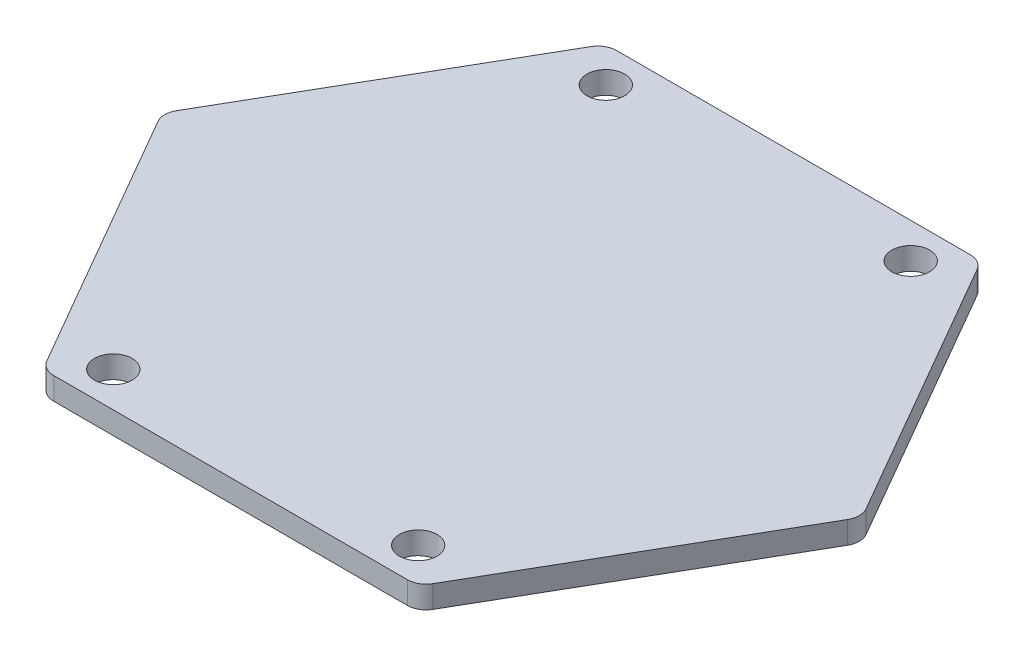
ISO-10303-21;
HEADER;
FILE_DESCRIPTION(('STEP AP214'),'2;1');
FILE_NAME('part.step','',(''),(''),'','','');
FILE_SCHEMA(('AUTOMOTIVE_DESIGN { 1 0 10303 214 1 1 1 1 }'));
ENDSEC;
DATA;
#1=APPLICATION_CONTEXT('core data for automotive mechanical design processes');
#2=APPLICATION_PROTOCOL_DEFINITION('international standard','automotive_design',2000,#1);
#3=PRODUCT_CONTEXT('',#1,'mechanical');
#4=PRODUCT('Part','Part','',(#3));
#5=PRODUCT_RELATED_PRODUCT_CATEGORY('part','',(#4));
#6=PRODUCT_DEFINITION_FORMATION('','',#4);
#7=PRODUCT_DEFINITION_CONTEXT('part definition',#1,'design');
#8=PRODUCT_DEFINITION('design','',#6,#7);
#9=PRODUCT_DEFINITION_SHAPE('','',#8);
#10=(LENGTH_UNIT() NAMED_UNIT(*) SI_UNIT(.MILLI.,.METRE.));
#11=(NAMED_UNIT(*) PLANE_ANGLE_UNIT() SI_UNIT($,.RADIAN.));
#12=(NAMED_UNIT(*) SI_UNIT($,.STERADIAN.) SOLID_ANGLE_UNIT());
#13=UNCERTAINTY_MEASURE_WITH_UNIT(LENGTH_MEASURE(1.E-05),#10,'distance_accuracy_value','');
#14=(GEOMETRIC_REPRESENTATION_CONTEXT(3) GLOBAL_UNCERTAINTY_ASSIGNED_CONTEXT((#13)) GLOBAL_UNIT_ASSIGNED_CONTEXT((#10,
#11,#12)) REPRESENTATION_CONTEXT('',''));
#15=CARTESIAN_POINT('',(0.,0.,0.));
#16=DIRECTION('',(0.,0.,1.));
#17=DIRECTION('',(1.,0.,0.));
#18=AXIS2_PLACEMENT_3D('',#15,#16,#17);
#19=CARTESIAN_POINT('',(0.,31.8516,0.));
#20=DIRECTION('',(0.,1.,0.));
#21=DIRECTION('',(0.,0.,1.));
#22=AXIS2_PLACEMENT_3D('',#19,#20,#21);
#23=PLANE('',#22);
#24=CARTESIAN_POINT('',(-20.6375,31.8516,138.2395));
#25=DIRECTION('',(0.,1.,0.));
#26=DIRECTION('',(0.,0.,1.));
#27=AXIS2_PLACEMENT_3D('',#24,#25,#26);
#28=CIRCLE('',#27,2.5527);
#29=CARTESIAN_POINT('',(-20.6375,31.8516,140.7922));
#30=VERTEX_POINT('',#29);
#31=EDGE_CURVE('E294',#30,#30,#28,.T.);
#32=ORIENTED_EDGE('',*,*,#31,.F.);
#33=EDGE_LOOP('',(#32));
#34=FACE_BOUND('',#33,.T.);
#35=CARTESIAN_POINT('',(20.6375,31.8516,71.5645));
#36=DIRECTION('',(0.,1.,0.));
#37=DIRECTION('',(0.,0.,1.));
#38=AXIS2_PLACEMENT_3D('',#35,#36,#37);
#39=CIRCLE('',#38,2.5527);
#40=CARTESIAN_POINT('',(20.6375,31.8516,74.1172));
#41=VERTEX_POINT('',#40);
#42=EDGE_CURVE('E233',#41,#41,#39,.T.);
#43=ORIENTED_EDGE('',*,*,#42,.F.);
#44=EDGE_LOOP('',(#43));
#45=FACE_BOUND('',#44,.T.);
#46=DIRECTION('',(-0.500000000000001,0.,0.866025403784438));
#47=VECTOR('',#46,1.);
#48=CARTESIAN_POINT('',(-47.3970452561248,31.8516,104.902));
#49=LINE('',#48,#47);
#50=CARTESIAN_POINT('',(-26.1332348418708,31.8516,68.072));
#51=VERTEX_POINT('',#50);
#52=CARTESIAN_POINT('',(-46.663810414254,31.8516,103.632));
#53=VERTEX_POINT('',#52);
#54=EDGE_CURVE('E226',#51,#53,#49,.T.);
#55=ORIENTED_EDGE('',*,*,#54,.T.);
#56=CARTESIAN_POINT('',(-44.4641058886415,31.8516,104.902));
#57=DIRECTION('',(0.,1.,0.));
#58=DIRECTION('',(0.,0.,1.));
#59=AXIS2_PLACEMENT_3D('',#56,#57,#58);
#60=CIRCLE('',#59,2.54);
#61=CARTESIAN_POINT('',(-46.663810414254,31.8516,106.172));
#62=VERTEX_POINT('',#61);
#63=EDGE_CURVE('E182',#53,#62,#60,.T.);
#64=ORIENTED_EDGE('',*,*,#63,.T.);
#65=DIRECTION('',(0.500000000000001,0.,0.866025403784438));
#66=VECTOR('',#65,1.);
#67=CARTESIAN_POINT('',(-25.4,31.8516,143.002));
#68=LINE('',#67,#66);
#69=CARTESIAN_POINT('',(-26.1332348418708,31.8516,141.732));
#70=VERTEX_POINT('',#69);
#71=EDGE_CURVE('E144',#62,#70,#68,.T.);
#72=ORIENTED_EDGE('',*,*,#71,.T.);
#73=CARTESIAN_POINT('',(-23.9335303162583,31.8516,140.462));
#74=DIRECTION('',(0.,1.,0.));
#75=DIRECTION('',(0.,0.,1.));
#76=AXIS2_PLACEMENT_3D('',#73,#74,#75);
#77=CIRCLE('',#76,2.54);
#78=CARTESIAN_POINT('',(-23.9335303162583,31.8516,143.002));
#79=VERTEX_POINT('',#78);
#80=EDGE_CURVE('E56',#70,#79,#77,.T.);
#81=ORIENTED_EDGE('',*,*,#80,.T.);
#82=DIRECTION('',(1.,0.,0.));
#83=VECTOR('',#82,1.);
#84=CARTESIAN_POINT('',(-25.4,31.8516,143.002));
#85=LINE('',#84,#83);
#86=CARTESIAN_POINT('',(23.9335303162583,31.8516,143.002));
#87=VERTEX_POINT('',#86);
#88=EDGE_CURVE('E160',#79,#87,#85,.T.);
#89=ORIENTED_EDGE('',*,*,#88,.T.);
#90=CARTESIAN_POINT('',(23.9335303162583,31.8516,140.462));
#91=DIRECTION('',(0.,1.,0.));
#92=DIRECTION('',(0.,0.,1.));
#93=AXIS2_PLACEMENT_3D('',#90,#91,#92);
#94=CIRCLE('',#93,2.54);
#95=CARTESIAN_POINT('',(26.1332348418708,31.8516,141.732));
#96=VERTEX_POINT('',#95);
#97=EDGE_CURVE('E174',#87,#96,#94,.T.);
#98=ORIENTED_EDGE('',*,*,#97,.T.);
#99=DIRECTION('',(0.500000000000001,0.,-0.866025403784438));
#100=VECTOR('',#99,1.);
#101=CARTESIAN_POINT('',(47.3970452561248,31.8516,104.902));
#102=LINE('',#101,#100);
#103=CARTESIAN_POINT('',(46.663810414254,31.8516,106.172));
#104=VERTEX_POINT('',#103);
#105=EDGE_CURVE('E154',#96,#104,#102,.T.);
#106=ORIENTED_EDGE('',*,*,#105,.T.);
#107=CARTESIAN_POINT('',(44.4641058886415,31.8516,104.902));
#108=DIRECTION('',(0.,1.,0.));
#109=DIRECTION('',(0.,0.,1.));
#110=AXIS2_PLACEMENT_3D('',#107,#108,#109);
#111=CIRCLE('',#110,2.54);
#112=CARTESIAN_POINT('',(46.663810414254,31.8516,103.632));
#113=VERTEX_POINT('',#112);
#114=EDGE_CURVE('E176',#104,#113,#111,.T.);
#115=ORIENTED_EDGE('',*,*,#114,.T.);
#116=DIRECTION('',(-0.500000000000001,0.,-0.866025403784438));
#117=VECTOR('',#116,1.);
#118=CARTESIAN_POINT('',(25.4,31.8516,66.802));
#119=LINE('',#118,#117);
#120=CARTESIAN_POINT('',(26.1332348418708,31.8516,68.072));
#121=VERTEX_POINT('',#120);
#122=EDGE_CURVE('E215',#113,#121,#119,.T.);
#123=ORIENTED_EDGE('',*,*,#122,.T.);
#124=CARTESIAN_POINT('',(23.9335303162583,31.8516,69.342));
#125=DIRECTION('',(0.,1.,0.));
#126=DIRECTION('',(0.,0.,1.));
#127=AXIS2_PLACEMENT_3D('',#124,#125,#126);
#128=CIRCLE('',#127,2.54);
#129=CARTESIAN_POINT('',(23.9335303162583,31.8516,66.802));
#130=VERTEX_POINT('',#129);
#131=EDGE_CURVE('E178',#121,#130,#128,.T.);
#132=ORIENTED_EDGE('',*,*,#131,.T.);
#133=DIRECTION('',(-1.,0.,0.));
#134=VECTOR('',#133,1.);
#135=CARTESIAN_POINT('',(-25.4,31.8516,66.802));
#136=LINE('',#135,#134);
#137=CARTESIAN_POINT('',(-23.9335303162584,31.8516,66.802));
#138=VERTEX_POINT('',#137);
#139=EDGE_CURVE('E218',#130,#138,#136,.T.);
#140=ORIENTED_EDGE('',*,*,#139,.T.);
#141=CARTESIAN_POINT('',(-23.9335303162584,31.8516,69.342));
#142=DIRECTION('',(0.,1.,0.));
#143=DIRECTION('',(0.,0.,1.));
#144=AXIS2_PLACEMENT_3D('',#141,#142,#143);
#145=CIRCLE('',#144,2.54);
#146=EDGE_CURVE('E180',#138,#51,#145,.T.);
#147=ORIENTED_EDGE('',*,*,#146,.T.);
#148=EDGE_LOOP('',(#55,#64,#72,#81,#89,#98,#106,#115,#123,#132,#140,#147));
#149=FACE_BOUND('',#148,.T.);
#150=CARTESIAN_POINT('',(-20.6375,31.8516,71.5645));
#151=DIRECTION('',(0.,1.,0.));
#152=DIRECTION('',(0.,0.,1.));
#153=AXIS2_PLACEMENT_3D('',#150,#151,#152);
#154=CIRCLE('',#153,2.5527);
#155=CARTESIAN_POINT('',(-20.6375,31.8516,74.1172));
#156=VERTEX_POINT('',#155);
#157=EDGE_CURVE('E288',#156,#156,#154,.T.);
#158=ORIENTED_EDGE('',*,*,#157,.F.);
#159=EDGE_LOOP('',(#158));
#160=FACE_BOUND('',#159,.T.);
#161=CARTESIAN_POINT('',(20.6375,31.8516,138.2395));
#162=DIRECTION('',(0.,1.,0.));
#163=DIRECTION('',(0.,0.,1.));
#164=AXIS2_PLACEMENT_3D('',#161,#162,#163);
#165=CIRCLE('',#164,2.5527);
#166=CARTESIAN_POINT('',(20.6375,31.8516,140.7922));
#167=VERTEX_POINT('',#166);
#168=EDGE_CURVE('E300',#167,#167,#165,.T.);
#169=ORIENTED_EDGE('',*,*,#168,.F.);
#170=EDGE_LOOP('',(#169));
#171=FACE_BOUND('',#170,.T.);
#172=ADVANCED_FACE('F36',(#34,#45,#149,#160,#171),#23,.T.);
#173=CARTESIAN_POINT('',(0.,28.829,0.));
#174=DIRECTION('',(0.,1.,0.));
#175=DIRECTION('',(0.,0.,1.));
#176=AXIS2_PLACEMENT_3D('',#173,#174,#175);
#177=PLANE('',#176);
#178=DIRECTION('',(0.500000000000001,0.,0.866025403784438));
#179=VECTOR('',#178,1.);
#180=CARTESIAN_POINT('',(-25.4,28.829,143.002));
#181=LINE('',#180,#179);
#182=CARTESIAN_POINT('',(-46.663810414254,28.829,106.172));
#183=VERTEX_POINT('',#182);
#184=CARTESIAN_POINT('',(-26.1332348418708,28.829,141.732));
#185=VERTEX_POINT('',#184);
#186=EDGE_CURVE('E142',#183,#185,#181,.T.);
#187=ORIENTED_EDGE('',*,*,#186,.F.);
#188=CARTESIAN_POINT('',(-44.4641058886415,28.829,104.902));
#189=DIRECTION('',(0.,1.,0.));
#190=DIRECTION('',(0.,0.,1.));
#191=AXIS2_PLACEMENT_3D('',#188,#189,#190);
#192=CIRCLE('',#191,2.54);
#193=CARTESIAN_POINT('',(-46.663810414254,28.829,103.632));
#194=VERTEX_POINT('',#193);
#195=EDGE_CURVE('E125',#183,#194,#192,.F.);
#196=ORIENTED_EDGE('',*,*,#195,.T.);
#197=DIRECTION('',(-0.500000000000001,0.,0.866025403784438));
#198=VECTOR('',#197,1.);
#199=CARTESIAN_POINT('',(-47.3970452561248,28.829,104.902));
#200=LINE('',#199,#198);
#201=CARTESIAN_POINT('',(-26.1332348418708,28.829,68.072));
#202=VERTEX_POINT('',#201);
#203=EDGE_CURVE('E152',#202,#194,#200,.T.);
#204=ORIENTED_EDGE('',*,*,#203,.F.);
#205=CARTESIAN_POINT('',(-23.9335303162584,28.829,69.342));
#206=DIRECTION('',(0.,1.,0.));
#207=DIRECTION('',(0.,0.,1.));
#208=AXIS2_PLACEMENT_3D('',#205,#206,#207);
#209=CIRCLE('',#208,2.54);
#210=CARTESIAN_POINT('',(-23.9335303162584,28.829,66.802));
#211=VERTEX_POINT('',#210);
#212=EDGE_CURVE('E136',#202,#211,#209,.F.);
#213=ORIENTED_EDGE('',*,*,#212,.T.);
#214=DIRECTION('',(-1.,0.,0.));
#215=VECTOR('',#214,1.);
#216=CARTESIAN_POINT('',(-25.4,28.829,66.802));
#217=LINE('',#216,#215);
#218=CARTESIAN_POINT('',(23.9335303162583,28.829,66.802));
#219=VERTEX_POINT('',#218);
#220=EDGE_CURVE('E156',#219,#211,#217,.T.);
#221=ORIENTED_EDGE('',*,*,#220,.F.);
#222=CARTESIAN_POINT('',(23.9335303162583,28.829,69.342));
#223=DIRECTION('',(0.,1.,0.));
#224=DIRECTION('',(0.,0.,1.));
#225=AXIS2_PLACEMENT_3D('',#222,#223,#224);
#226=CIRCLE('',#225,2.54);
#227=CARTESIAN_POINT('',(26.1332348418708,28.829,68.072));
#228=VERTEX_POINT('',#227);
#229=EDGE_CURVE('E167',#219,#228,#226,.F.);
#230=ORIENTED_EDGE('',*,*,#229,.T.);
#231=DIRECTION('',(-0.500000000000001,0.,-0.866025403784438));
#232=VECTOR('',#231,1.);
#233=CARTESIAN_POINT('',(25.4,28.829,66.802));
#234=LINE('',#233,#232);
#235=CARTESIAN_POINT('',(46.663810414254,28.829,103.632));
#236=VERTEX_POINT('',#235);
#237=EDGE_CURVE('E232',#236,#228,#234,.T.);
#238=ORIENTED_EDGE('',*,*,#237,.F.);
#239=CARTESIAN_POINT('',(44.4641058886415,28.829,104.902));
#240=DIRECTION('',(0.,1.,0.));
#241=DIRECTION('',(0.,0.,1.));
#242=AXIS2_PLACEMENT_3D('',#239,#240,#241);
#243=CIRCLE('',#242,2.54);
#244=CARTESIAN_POINT('',(46.663810414254,28.829,106.172));
#245=VERTEX_POINT('',#244);
#246=EDGE_CURVE('E165',#236,#245,#243,.F.);
#247=ORIENTED_EDGE('',*,*,#246,.T.);
#248=DIRECTION('',(0.500000000000001,0.,-0.866025403784438));
#249=VECTOR('',#248,1.);
#250=CARTESIAN_POINT('',(47.3970452561248,28.829,104.902));
#251=LINE('',#250,#249);
#252=CARTESIAN_POINT('',(26.1332348418708,28.829,141.732));
#253=VERTEX_POINT('',#252);
#254=EDGE_CURVE('E204',#253,#245,#251,.T.);
#255=ORIENTED_EDGE('',*,*,#254,.F.);
#256=CARTESIAN_POINT('',(23.9335303162583,28.829,140.462));
#257=DIRECTION('',(0.,1.,0.));
#258=DIRECTION('',(0.,0.,1.));
#259=AXIS2_PLACEMENT_3D('',#256,#257,#258);
#260=CIRCLE('',#259,2.54);
#261=CARTESIAN_POINT('',(23.9335303162583,28.829,143.002));
#262=VERTEX_POINT('',#261);
#263=EDGE_CURVE('E163',#253,#262,#260,.F.);
#264=ORIENTED_EDGE('',*,*,#263,.T.);
#265=DIRECTION('',(1.,0.,0.));
#266=VECTOR('',#265,1.);
#267=CARTESIAN_POINT('',(-25.4,28.829,143.002));
#268=LINE('',#267,#266);
#269=CARTESIAN_POINT('',(-23.9335303162583,28.829,143.002));
#270=VERTEX_POINT('',#269);
#271=EDGE_CURVE('E151',#270,#262,#268,.T.);
#272=ORIENTED_EDGE('',*,*,#271,.F.);
#273=CARTESIAN_POINT('',(-23.9335303162583,28.829,140.462));
#274=DIRECTION('',(0.,1.,0.));
#275=DIRECTION('',(0.,0.,1.));
#276=AXIS2_PLACEMENT_3D('',#273,#274,#275);
#277=CIRCLE('',#276,2.54);
#278=EDGE_CURVE('E145',#270,#185,#277,.F.);
#279=ORIENTED_EDGE('',*,*,#278,.T.);
#280=EDGE_LOOP('',(#187,#196,#204,#213,#221,#230,#238,#247,#255,#264,#272,#279));
#281=FACE_BOUND('',#280,.T.);
#282=CARTESIAN_POINT('',(20.6375,28.829,71.5645));
#283=DIRECTION('',(0.,1.,0.));
#284=DIRECTION('',(0.,0.,1.));
#285=AXIS2_PLACEMENT_3D('',#282,#283,#284);
#286=CIRCLE('',#285,2.5527);
#287=CARTESIAN_POINT('',(20.6375,28.829,74.1172));
#288=VERTEX_POINT('',#287);
#289=EDGE_CURVE('E221',#288,#288,#286,.T.);
#290=ORIENTED_EDGE('',*,*,#289,.T.);
#291=EDGE_LOOP('',(#290));
#292=FACE_BOUND('',#291,.T.);
#293=CARTESIAN_POINT('',(-20.6375,28.829,71.5645));
#294=DIRECTION('',(0.,1.,0.));
#295=DIRECTION('',(0.,0.,1.));
#296=AXIS2_PLACEMENT_3D('',#293,#294,#295);
#297=CIRCLE('',#296,2.5527);
#298=CARTESIAN_POINT('',(-20.6375,28.829,74.1172));
#299=VERTEX_POINT('',#298);
#300=EDGE_CURVE('E290',#299,#299,#297,.T.);
#301=ORIENTED_EDGE('',*,*,#300,.T.);
#302=EDGE_LOOP('',(#301));
#303=FACE_BOUND('',#302,.T.);
#304=CARTESIAN_POINT('',(-20.6375,28.829,138.2395));
#305=DIRECTION('',(0.,1.,0.));
#306=DIRECTION('',(0.,0.,1.));
#307=AXIS2_PLACEMENT_3D('',#304,#305,#306);
#308=CIRCLE('',#307,2.5527);
#309=CARTESIAN_POINT('',(-20.6375,28.829,140.7922));
#310=VERTEX_POINT('',#309);
#311=EDGE_CURVE('E297',#310,#310,#308,.T.);
#312=ORIENTED_EDGE('',*,*,#311,.T.);
#313=EDGE_LOOP('',(#312));
#314=FACE_BOUND('',#313,.T.);
#315=CARTESIAN_POINT('',(20.6375,28.829,138.2395));
#316=DIRECTION('',(0.,1.,0.));
#317=DIRECTION('',(0.,0.,1.));
#318=AXIS2_PLACEMENT_3D('',#315,#316,#317);
#319=CIRCLE('',#318,2.5527);
#320=CARTESIAN_POINT('',(20.6375,28.829,140.7922));
#321=VERTEX_POINT('',#320);
#322=EDGE_CURVE('E303',#321,#321,#319,.T.);
#323=ORIENTED_EDGE('',*,*,#322,.T.);
#324=EDGE_LOOP('',(#323));
#325=FACE_BOUND('',#324,.T.);
#326=ADVANCED_FACE('F148',(#281,#292,#303,#314,#325),#177,.F.);
#327=CARTESIAN_POINT('',(47.3970452561248,31.8516,104.902));
#328=DIRECTION('',(-0.866025403784438,0.,-0.500000000000001));
#329=DIRECTION('',(-0.500000000000001,0.,0.866025403784438));
#330=AXIS2_PLACEMENT_3D('',#327,#328,#329);
#331=PLANE('',#330);
#332=ORIENTED_EDGE('',*,*,#254,.T.);
#333=DIRECTION('',(0.,-1.,0.));
#334=VECTOR('',#333,1.);
#335=CARTESIAN_POINT('',(46.663810414254,31.8516,106.172));
#336=LINE('',#335,#334);
#337=EDGE_CURVE('E197',#245,#104,#336,.F.);
#338=ORIENTED_EDGE('',*,*,#337,.T.);
#339=ORIENTED_EDGE('',*,*,#105,.F.);
#340=DIRECTION('',(0.,-1.,0.));
#341=VECTOR('',#340,1.);
#342=CARTESIAN_POINT('',(26.1332348418708,31.8516,141.732));
#343=LINE('',#342,#341);
#344=EDGE_CURVE('E194',#96,#253,#343,.T.);
#345=ORIENTED_EDGE('',*,*,#344,.T.);
#346=EDGE_LOOP('',(#332,#338,#339,#345));
#347=FACE_BOUND('',#346,.T.);
#348=ADVANCED_FACE('F211',(#347),#331,.F.);
#349=CARTESIAN_POINT('',(25.4,31.8516,66.802));
#350=DIRECTION('',(-0.866025403784438,0.,0.500000000000001));
#351=DIRECTION('',(0.500000000000001,0.,0.866025403784438));
#352=AXIS2_PLACEMENT_3D('',#349,#350,#351);
#353=PLANE('',#352);
#354=ORIENTED_EDGE('',*,*,#237,.T.);
#355=DIRECTION('',(0.,-1.,0.));
#356=VECTOR('',#355,1.);
#357=CARTESIAN_POINT('',(26.1332348418708,31.8516,68.072));
#358=LINE('',#357,#356);
#359=EDGE_CURVE('E192',#228,#121,#358,.F.);
#360=ORIENTED_EDGE('',*,*,#359,.T.);
#361=ORIENTED_EDGE('',*,*,#122,.F.);
#362=DIRECTION('',(0.,-1.,0.));
#363=VECTOR('',#362,1.);
#364=CARTESIAN_POINT('',(46.663810414254,31.8516,103.632));
#365=LINE('',#364,#363);
#366=EDGE_CURVE('E189',#113,#236,#365,.T.);
#367=ORIENTED_EDGE('',*,*,#366,.T.);
#368=EDGE_LOOP('',(#354,#360,#361,#367));
#369=FACE_BOUND('',#368,.T.);
#370=ADVANCED_FACE('F257',(#369),#353,.F.);
#371=CARTESIAN_POINT('',(-25.4,31.8516,66.802));
#372=DIRECTION('',(0.,0.,1.));
#373=DIRECTION('',(1.,0.,0.));
#374=AXIS2_PLACEMENT_3D('',#371,#372,#373);
#375=PLANE('',#374);
#376=ORIENTED_EDGE('',*,*,#220,.T.);
#377=DIRECTION('',(0.,-1.,0.));
#378=VECTOR('',#377,1.);
#379=CARTESIAN_POINT('',(-23.9335303162584,31.8516,66.802));
#380=LINE('',#379,#378);
#381=EDGE_CURVE('E187',#211,#138,#380,.F.);
#382=ORIENTED_EDGE('',*,*,#381,.T.);
#383=ORIENTED_EDGE('',*,*,#139,.F.);
#384=DIRECTION('',(0.,-1.,0.));
#385=VECTOR('',#384,1.);
#386=CARTESIAN_POINT('',(23.9335303162583,31.8516,66.802));
#387=LINE('',#386,#385);
#388=EDGE_CURVE('E184',#130,#219,#387,.T.);
#389=ORIENTED_EDGE('',*,*,#388,.T.);
#390=EDGE_LOOP('',(#376,#382,#383,#389));
#391=FACE_BOUND('',#390,.T.);
#392=ADVANCED_FACE('F239',(#391),#375,.F.);
#393=CARTESIAN_POINT('',(-47.3970452561248,31.8516,104.902));
#394=DIRECTION('',(0.866025403784438,0.,0.500000000000001));
#395=DIRECTION('',(0.500000000000001,0.,-0.866025403784438));
#396=AXIS2_PLACEMENT_3D('',#393,#394,#395);
#397=PLANE('',#396);
#398=ORIENTED_EDGE('',*,*,#203,.T.);
#399=DIRECTION('',(0.,-1.,0.));
#400=VECTOR('',#399,1.);
#401=CARTESIAN_POINT('',(-46.663810414254,31.8516,103.632));
#402=LINE('',#401,#400);
#403=EDGE_CURVE('E130',#194,#53,#402,.F.);
#404=ORIENTED_EDGE('',*,*,#403,.T.);
#405=ORIENTED_EDGE('',*,*,#54,.F.);
#406=DIRECTION('',(0.,-1.,0.));
#407=VECTOR('',#406,1.);
#408=CARTESIAN_POINT('',(-26.1332348418708,31.8516,68.072));
#409=LINE('',#408,#407);
#410=EDGE_CURVE('E135',#51,#202,#409,.T.);
#411=ORIENTED_EDGE('',*,*,#410,.T.);
#412=EDGE_LOOP('',(#398,#404,#405,#411));
#413=FACE_BOUND('',#412,.T.);
#414=ADVANCED_FACE('F249',(#413),#397,.F.);
#415=CARTESIAN_POINT('',(-25.4,31.8516,143.002));
#416=DIRECTION('',(0.866025403784438,0.,-0.500000000000001));
#417=DIRECTION('',(-0.500000000000001,0.,-0.866025403784438));
#418=AXIS2_PLACEMENT_3D('',#415,#416,#417);
#419=PLANE('',#418);
#420=ORIENTED_EDGE('',*,*,#71,.F.);
#421=DIRECTION('',(0.,-1.,0.));
#422=VECTOR('',#421,1.);
#423=CARTESIAN_POINT('',(-46.663810414254,31.8516,106.172));
#424=LINE('',#423,#422);
#425=EDGE_CURVE('E129',#62,#183,#424,.T.);
#426=ORIENTED_EDGE('',*,*,#425,.T.);
#427=ORIENTED_EDGE('',*,*,#186,.T.);
#428=DIRECTION('',(0.,-1.,0.));
#429=VECTOR('',#428,1.);
#430=CARTESIAN_POINT('',(-26.1332348418708,31.8516,141.732));
#431=LINE('',#430,#429);
#432=EDGE_CURVE('E146',#185,#70,#431,.F.);
#433=ORIENTED_EDGE('',*,*,#432,.T.);
#434=EDGE_LOOP('',(#420,#426,#427,#433));
#435=FACE_BOUND('',#434,.T.);
#436=ADVANCED_FACE('F141',(#435),#419,.F.);
#437=CARTESIAN_POINT('',(-25.4,31.8516,143.002));
#438=DIRECTION('',(0.,0.,-1.));
#439=DIRECTION('',(-1.,0.,0.));
#440=AXIS2_PLACEMENT_3D('',#437,#438,#439);
#441=PLANE('',#440);
#442=ORIENTED_EDGE('',*,*,#271,.T.);
#443=DIRECTION('',(0.,-1.,0.));
#444=VECTOR('',#443,1.);
#445=CARTESIAN_POINT('',(23.9335303162583,31.8516,143.002));
#446=LINE('',#445,#444);
#447=EDGE_CURVE('E11',#262,#87,#446,.F.);
#448=ORIENTED_EDGE('',*,*,#447,.T.);
#449=ORIENTED_EDGE('',*,*,#88,.F.);
#450=DIRECTION('',(0.,-1.,0.));
#451=VECTOR('',#450,1.);
#452=CARTESIAN_POINT('',(-23.9335303162583,31.8516,143.002));
#453=LINE('',#452,#451);
#454=EDGE_CURVE('E44',#79,#270,#453,.T.);
#455=ORIENTED_EDGE('',*,*,#454,.T.);
#456=EDGE_LOOP('',(#442,#448,#449,#455));
#457=FACE_BOUND('',#456,.T.);
#458=ADVANCED_FACE('F200',(#457),#441,.F.);
#459=CARTESIAN_POINT('',(20.6375,31.8516,71.5645));
#460=DIRECTION('',(0.,-1.,0.));
#461=DIRECTION('',(0.,0.,-1.));
#462=AXIS2_PLACEMENT_3D('',#459,#460,#461);
#463=CYLINDRICAL_SURFACE('',#462,2.5527);
#464=ORIENTED_EDGE('',*,*,#42,.T.);
#465=EDGE_LOOP('',(#464));
#466=FACE_BOUND('',#465,.T.);
#467=ORIENTED_EDGE('',*,*,#289,.F.);
#468=EDGE_LOOP('',(#467));
#469=FACE_BOUND('',#468,.T.);
#470=ADVANCED_FACE('F269',(#466,#469),#463,.F.);
#471=CARTESIAN_POINT('',(-20.6375,31.8516,71.5645));
#472=DIRECTION('',(0.,-1.,0.));
#473=DIRECTION('',(0.,0.,-1.));
#474=AXIS2_PLACEMENT_3D('',#471,#472,#473);
#475=CYLINDRICAL_SURFACE('',#474,2.5527);
#476=ORIENTED_EDGE('',*,*,#157,.T.);
#477=EDGE_LOOP('',(#476));
#478=FACE_BOUND('',#477,.T.);
#479=ORIENTED_EDGE('',*,*,#300,.F.);
#480=EDGE_LOOP('',(#479));
#481=FACE_BOUND('',#480,.T.);
#482=ADVANCED_FACE('F276',(#478,#481),#475,.F.);
#483=CARTESIAN_POINT('',(-20.6375,31.8516,138.2395));
#484=DIRECTION('',(0.,-1.,0.));
#485=DIRECTION('',(0.,0.,-1.));
#486=AXIS2_PLACEMENT_3D('',#483,#484,#485);
#487=CYLINDRICAL_SURFACE('',#486,2.5527);
#488=ORIENTED_EDGE('',*,*,#31,.T.);
#489=EDGE_LOOP('',(#488));
#490=FACE_BOUND('',#489,.T.);
#491=ORIENTED_EDGE('',*,*,#311,.F.);
#492=EDGE_LOOP('',(#491));
#493=FACE_BOUND('',#492,.T.);
#494=ADVANCED_FACE('F281',(#490,#493),#487,.F.);
#495=CARTESIAN_POINT('',(20.6375,31.8516,138.2395));
#496=DIRECTION('',(0.,-1.,0.));
#497=DIRECTION('',(0.,0.,-1.));
#498=AXIS2_PLACEMENT_3D('',#495,#496,#497);
#499=CYLINDRICAL_SURFACE('',#498,2.5527);
#500=ORIENTED_EDGE('',*,*,#168,.T.);
#501=EDGE_LOOP('',(#500));
#502=FACE_BOUND('',#501,.T.);
#503=ORIENTED_EDGE('',*,*,#322,.F.);
#504=EDGE_LOOP('',(#503));
#505=FACE_BOUND('',#504,.T.);
#506=ADVANCED_FACE('F309',(#502,#505),#499,.F.);
#507=CARTESIAN_POINT('',(-44.4641058886415,31.8516,104.902));
#508=DIRECTION('',(0.,-1.,0.));
#509=DIRECTION('',(0.,0.,-1.));
#510=AXIS2_PLACEMENT_3D('',#507,#508,#509);
#511=CYLINDRICAL_SURFACE('',#510,2.54);
#512=ORIENTED_EDGE('',*,*,#63,.F.);
#513=ORIENTED_EDGE('',*,*,#403,.F.);
#514=ORIENTED_EDGE('',*,*,#195,.F.);
#515=ORIENTED_EDGE('',*,*,#425,.F.);
#516=EDGE_LOOP('',(#512,#513,#514,#515));
#517=FACE_BOUND('',#516,.T.);
#518=ADVANCED_FACE('F128',(#517),#511,.T.);
#519=CARTESIAN_POINT('',(-23.9335303162584,31.8516,69.342));
#520=DIRECTION('',(0.,-1.,0.));
#521=DIRECTION('',(0.,0.,-1.));
#522=AXIS2_PLACEMENT_3D('',#519,#520,#521);
#523=CYLINDRICAL_SURFACE('',#522,2.54);
#524=ORIENTED_EDGE('',*,*,#146,.F.);
#525=ORIENTED_EDGE('',*,*,#381,.F.);
#526=ORIENTED_EDGE('',*,*,#212,.F.);
#527=ORIENTED_EDGE('',*,*,#410,.F.);
#528=EDGE_LOOP('',(#524,#525,#526,#527));
#529=FACE_BOUND('',#528,.T.);
#530=ADVANCED_FACE('F244',(#529),#523,.T.);
#531=CARTESIAN_POINT('',(23.9335303162583,31.8516,69.342));
#532=DIRECTION('',(0.,-1.,0.));
#533=DIRECTION('',(0.,0.,-1.));
#534=AXIS2_PLACEMENT_3D('',#531,#532,#533);
#535=CYLINDRICAL_SURFACE('',#534,2.54);
#536=ORIENTED_EDGE('',*,*,#131,.F.);
#537=ORIENTED_EDGE('',*,*,#359,.F.);
#538=ORIENTED_EDGE('',*,*,#229,.F.);
#539=ORIENTED_EDGE('',*,*,#388,.F.);
#540=EDGE_LOOP('',(#536,#537,#538,#539));
#541=FACE_BOUND('',#540,.T.);
#542=ADVANCED_FACE('F399',(#541),#535,.T.);
#543=CARTESIAN_POINT('',(44.4641058886415,31.8516,104.902));
#544=DIRECTION('',(0.,-1.,0.));
#545=DIRECTION('',(0.,0.,-1.));
#546=AXIS2_PLACEMENT_3D('',#543,#544,#545);
#547=CYLINDRICAL_SURFACE('',#546,2.54);
#548=ORIENTED_EDGE('',*,*,#114,.F.);
#549=ORIENTED_EDGE('',*,*,#337,.F.);
#550=ORIENTED_EDGE('',*,*,#246,.F.);
#551=ORIENTED_EDGE('',*,*,#366,.F.);
#552=EDGE_LOOP('',(#548,#549,#550,#551));
#553=FACE_BOUND('',#552,.T.);
#554=ADVANCED_FACE('F407',(#553),#547,.T.);
#555=CARTESIAN_POINT('',(23.9335303162583,31.8516,140.462));
#556=DIRECTION('',(0.,-1.,0.));
#557=DIRECTION('',(0.,0.,-1.));
#558=AXIS2_PLACEMENT_3D('',#555,#556,#557);
#559=CYLINDRICAL_SURFACE('',#558,2.54);
#560=ORIENTED_EDGE('',*,*,#97,.F.);
#561=ORIENTED_EDGE('',*,*,#447,.F.);
#562=ORIENTED_EDGE('',*,*,#263,.F.);
#563=ORIENTED_EDGE('',*,*,#344,.F.);
#564=EDGE_LOOP('',(#560,#561,#562,#563));
#565=FACE_BOUND('',#564,.T.);
#566=ADVANCED_FACE('F208',(#565),#559,.T.);
#567=CARTESIAN_POINT('',(-23.9335303162583,31.8516,140.462));
#568=DIRECTION('',(0.,-1.,0.));
#569=DIRECTION('',(0.,0.,-1.));
#570=AXIS2_PLACEMENT_3D('',#567,#568,#569);
#571=CYLINDRICAL_SURFACE('',#570,2.54);
#572=ORIENTED_EDGE('',*,*,#80,.F.);
#573=ORIENTED_EDGE('',*,*,#432,.F.);
#574=ORIENTED_EDGE('',*,*,#278,.F.);
#575=ORIENTED_EDGE('',*,*,#454,.F.);
#576=EDGE_LOOP('',(#572,#573,#574,#575));
#577=FACE_BOUND('',#576,.T.);
#578=ADVANCED_FACE('F38',(#577),#571,.T.);
#579=CLOSED_SHELL('',(#172,#326,#348,#370,#392,#414,#436,#458,#470,#482,#494,#506,#518,#530,
#542,#554,#566,#578));
#580=MANIFOLD_SOLID_BREP('B2',#579);
#581=ADVANCED_BREP_SHAPE_REPRESENTATION('',(#18,#580),#14);
#582=SHAPE_DEFINITION_REPRESENTATION(#9,#581);
ENDSEC;
END-ISO-10303-21;
